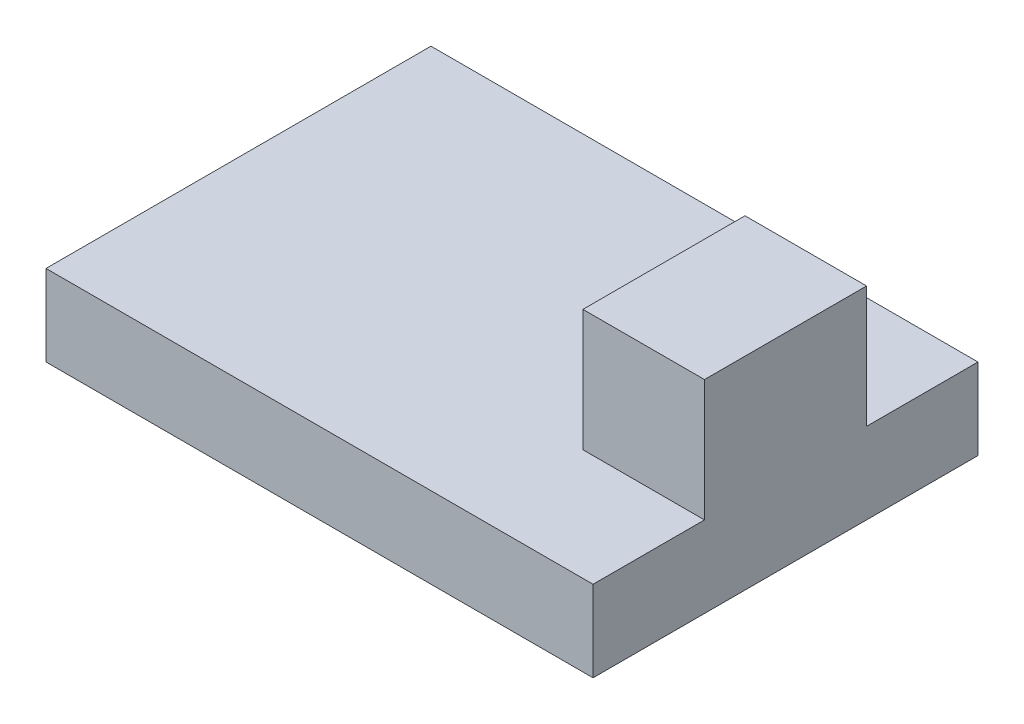
ISO-10303-21;
HEADER;
FILE_DESCRIPTION(('STEP AP214'),'2;1');
FILE_NAME('part.step','',(''),(''),'','','');
FILE_SCHEMA(('AUTOMOTIVE_DESIGN { 1 0 10303 214 1 1 1 1 }'));
ENDSEC;
DATA;
#1=APPLICATION_CONTEXT('core data for automotive mechanical design processes');
#2=APPLICATION_PROTOCOL_DEFINITION('international standard','automotive_design',2000,#1);
#3=PRODUCT_CONTEXT('',#1,'mechanical');
#4=PRODUCT('Part','Part','',(#3));
#5=PRODUCT_RELATED_PRODUCT_CATEGORY('part','',(#4));
#6=PRODUCT_DEFINITION_FORMATION('','',#4);
#7=PRODUCT_DEFINITION_CONTEXT('part definition',#1,'design');
#8=PRODUCT_DEFINITION('design','',#6,#7);
#9=PRODUCT_DEFINITION_SHAPE('','',#8);
#10=(LENGTH_UNIT() NAMED_UNIT(*) SI_UNIT(.MILLI.,.METRE.));
#11=(NAMED_UNIT(*) PLANE_ANGLE_UNIT() SI_UNIT($,.RADIAN.));
#12=(NAMED_UNIT(*) SI_UNIT($,.STERADIAN.) SOLID_ANGLE_UNIT());
#13=UNCERTAINTY_MEASURE_WITH_UNIT(LENGTH_MEASURE(1.E-05),#10,'distance_accuracy_value','');
#14=(GEOMETRIC_REPRESENTATION_CONTEXT(3) GLOBAL_UNCERTAINTY_ASSIGNED_CONTEXT((#13)) GLOBAL_UNIT_ASSIGNED_CONTEXT((#10,
#11,#12)) REPRESENTATION_CONTEXT('',''));
#15=CARTESIAN_POINT('',(0.,0.,0.));
#16=DIRECTION('',(0.,0.,1.));
#17=DIRECTION('',(1.,0.,0.));
#18=AXIS2_PLACEMENT_3D('',#15,#16,#17);
#19=CARTESIAN_POINT('',(-13.5,4.,9.5));
#20=DIRECTION('',(1.,0.,0.));
#21=DIRECTION('',(0.,0.,-1.));
#22=AXIS2_PLACEMENT_3D('',#19,#20,#21);
#23=PLANE('',#22);
#24=DIRECTION('',(0.,0.,1.));
#25=VECTOR('',#24,1.);
#26=CARTESIAN_POINT('',(-13.5,0.,9.5));
#27=LINE('',#26,#25);
#28=CARTESIAN_POINT('',(-13.5,0.,-9.5));
#29=VERTEX_POINT('',#28);
#30=CARTESIAN_POINT('',(-13.5,0.,9.5));
#31=VERTEX_POINT('',#30);
#32=EDGE_CURVE('E120',#29,#31,#27,.T.);
#33=ORIENTED_EDGE('',*,*,#32,.T.);
#34=DIRECTION('',(0.,-1.,0.));
#35=VECTOR('',#34,1.);
#36=CARTESIAN_POINT('',(-13.5,4.,9.5));
#37=LINE('',#36,#35);
#38=CARTESIAN_POINT('',(-13.5,4.,9.5));
#39=VERTEX_POINT('',#38);
#40=EDGE_CURVE('E11',#39,#31,#37,.T.);
#41=ORIENTED_EDGE('',*,*,#40,.F.);
#42=DIRECTION('',(0.,0.,1.));
#43=VECTOR('',#42,1.);
#44=CARTESIAN_POINT('',(-13.5,4.,9.5));
#45=LINE('',#44,#43);
#46=CARTESIAN_POINT('',(-13.5,4.,-9.5));
#47=VERTEX_POINT('',#46);
#48=EDGE_CURVE('E129',#47,#39,#45,.T.);
#49=ORIENTED_EDGE('',*,*,#48,.F.);
#50=DIRECTION('',(0.,-1.,0.));
#51=VECTOR('',#50,1.);
#52=CARTESIAN_POINT('',(-13.5,4.,-9.5));
#53=LINE('',#52,#51);
#54=EDGE_CURVE('E138',#47,#29,#53,.T.);
#55=ORIENTED_EDGE('',*,*,#54,.T.);
#56=EDGE_LOOP('',(#33,#41,#49,#55));
#57=FACE_BOUND('',#56,.T.);
#58=ADVANCED_FACE('F34',(#57),#23,.F.);
#59=CARTESIAN_POINT('',(13.5,4.,9.5));
#60=DIRECTION('',(0.,0.,-1.));
#61=DIRECTION('',(-1.,0.,0.));
#62=AXIS2_PLACEMENT_3D('',#59,#60,#61);
#63=PLANE('',#62);
#64=DIRECTION('',(1.,0.,0.));
#65=VECTOR('',#64,1.);
#66=CARTESIAN_POINT('',(13.5,0.,9.5));
#67=LINE('',#66,#65);
#68=CARTESIAN_POINT('',(13.5,0.,9.5));
#69=VERTEX_POINT('',#68);
#70=EDGE_CURVE('E123',#31,#69,#67,.T.);
#71=ORIENTED_EDGE('',*,*,#70,.T.);
#72=DIRECTION('',(0.,-1.,0.));
#73=VECTOR('',#72,1.);
#74=CARTESIAN_POINT('',(13.5,4.,9.5));
#75=LINE('',#74,#73);
#76=CARTESIAN_POINT('',(13.5,4.,9.5));
#77=VERTEX_POINT('',#76);
#78=EDGE_CURVE('E41',#77,#69,#75,.T.);
#79=ORIENTED_EDGE('',*,*,#78,.F.);
#80=DIRECTION('',(1.,0.,0.));
#81=VECTOR('',#80,1.);
#82=CARTESIAN_POINT('',(13.5,4.,9.5));
#83=LINE('',#82,#81);
#84=EDGE_CURVE('E132',#39,#77,#83,.T.);
#85=ORIENTED_EDGE('',*,*,#84,.F.);
#86=ORIENTED_EDGE('',*,*,#40,.T.);
#87=EDGE_LOOP('',(#71,#79,#85,#86));
#88=FACE_BOUND('',#87,.T.);
#89=ADVANCED_FACE('F165',(#88),#63,.F.);
#90=CARTESIAN_POINT('',(13.5,4.,9.5));
#91=DIRECTION('',(-1.,0.,0.));
#92=DIRECTION('',(0.,0.,1.));
#93=AXIS2_PLACEMENT_3D('',#90,#91,#92);
#94=PLANE('',#93);
#95=DIRECTION('',(0.,0.,-1.));
#96=VECTOR('',#95,1.);
#97=CARTESIAN_POINT('',(13.5,0.,9.5));
#98=LINE('',#97,#96);
#99=CARTESIAN_POINT('',(13.5,0.,-9.5));
#100=VERTEX_POINT('',#99);
#101=EDGE_CURVE('E141',#69,#100,#98,.T.);
#102=ORIENTED_EDGE('',*,*,#101,.T.);
#103=DIRECTION('',(0.,-1.,0.));
#104=VECTOR('',#103,1.);
#105=CARTESIAN_POINT('',(13.5,4.,-9.5));
#106=LINE('',#105,#104);
#107=CARTESIAN_POINT('',(13.5,4.,-9.5));
#108=VERTEX_POINT('',#107);
#109=EDGE_CURVE('E146',#108,#100,#106,.T.);
#110=ORIENTED_EDGE('',*,*,#109,.F.);
#111=DIRECTION('',(0.,0.,-1.));
#112=VECTOR('',#111,1.);
#113=CARTESIAN_POINT('',(13.5,4.,9.5));
#114=LINE('',#113,#112);
#115=CARTESIAN_POINT('',(13.5,4.,-4.));
#116=VERTEX_POINT('',#115);
#117=EDGE_CURVE('E119',#116,#108,#114,.T.);
#118=ORIENTED_EDGE('',*,*,#117,.F.);
#119=DIRECTION('',(0.,-1.,0.));
#120=VECTOR('',#119,1.);
#121=CARTESIAN_POINT('',(13.5,10.,-4.));
#122=LINE('',#121,#120);
#123=CARTESIAN_POINT('',(13.5,10.,-4.));
#124=VERTEX_POINT('',#123);
#125=EDGE_CURVE('E101',#124,#116,#122,.T.);
#126=ORIENTED_EDGE('',*,*,#125,.F.);
#127=DIRECTION('',(0.,0.,-1.));
#128=VECTOR('',#127,1.);
#129=CARTESIAN_POINT('',(13.5,10.,-4.));
#130=LINE('',#129,#128);
#131=CARTESIAN_POINT('',(13.5,10.,4.));
#132=VERTEX_POINT('',#131);
#133=EDGE_CURVE('E107',#132,#124,#130,.T.);
#134=ORIENTED_EDGE('',*,*,#133,.F.);
#135=DIRECTION('',(0.,-1.,0.));
#136=VECTOR('',#135,1.);
#137=CARTESIAN_POINT('',(13.5,10.,4.));
#138=LINE('',#137,#136);
#139=CARTESIAN_POINT('',(13.5,4.,4.));
#140=VERTEX_POINT('',#139);
#141=EDGE_CURVE('E252',#132,#140,#138,.T.);
#142=ORIENTED_EDGE('',*,*,#141,.T.);
#143=EDGE_CURVE('E135',#77,#140,#114,.T.);
#144=ORIENTED_EDGE('',*,*,#143,.F.);
#145=ORIENTED_EDGE('',*,*,#78,.T.);
#146=EDGE_LOOP('',(#102,#110,#118,#126,#134,#142,#144,#145));
#147=FACE_BOUND('',#146,.T.);
#148=ADVANCED_FACE('F117',(#147),#94,.F.);
#149=CARTESIAN_POINT('',(13.5,4.,-9.5));
#150=DIRECTION('',(0.,0.,1.));
#151=DIRECTION('',(1.,0.,0.));
#152=AXIS2_PLACEMENT_3D('',#149,#150,#151);
#153=PLANE('',#152);
#154=DIRECTION('',(-1.,0.,0.));
#155=VECTOR('',#154,1.);
#156=CARTESIAN_POINT('',(13.5,0.,-9.5));
#157=LINE('',#156,#155);
#158=EDGE_CURVE('E133',#100,#29,#157,.T.);
#159=ORIENTED_EDGE('',*,*,#158,.T.);
#160=ORIENTED_EDGE('',*,*,#54,.F.);
#161=DIRECTION('',(-1.,0.,0.));
#162=VECTOR('',#161,1.);
#163=CARTESIAN_POINT('',(13.5,4.,-9.5));
#164=LINE('',#163,#162);
#165=EDGE_CURVE('E137',#108,#47,#164,.T.);
#166=ORIENTED_EDGE('',*,*,#165,.F.);
#167=ORIENTED_EDGE('',*,*,#109,.T.);
#168=EDGE_LOOP('',(#159,#160,#166,#167));
#169=FACE_BOUND('',#168,.T.);
#170=ADVANCED_FACE('F159',(#169),#153,.F.);
#171=CARTESIAN_POINT('',(0.,4.,0.));
#172=DIRECTION('',(0.,1.,0.));
#173=DIRECTION('',(0.,0.,1.));
#174=AXIS2_PLACEMENT_3D('',#171,#172,#173);
#175=PLANE('',#174);
#176=DIRECTION('',(1.,0.,0.));
#177=VECTOR('',#176,1.);
#178=CARTESIAN_POINT('',(13.5,4.,4.));
#179=LINE('',#178,#177);
#180=CARTESIAN_POINT('',(7.5,4.,4.));
#181=VERTEX_POINT('',#180);
#182=EDGE_CURVE('E48',#181,#140,#179,.T.);
#183=ORIENTED_EDGE('',*,*,#182,.F.);
#184=DIRECTION('',(0.,0.,1.));
#185=VECTOR('',#184,1.);
#186=CARTESIAN_POINT('',(7.5,4.,-4.));
#187=LINE('',#186,#185);
#188=CARTESIAN_POINT('',(7.5,4.,-4.));
#189=VERTEX_POINT('',#188);
#190=EDGE_CURVE('E254',#189,#181,#187,.T.);
#191=ORIENTED_EDGE('',*,*,#190,.F.);
#192=DIRECTION('',(-1.,0.,0.));
#193=VECTOR('',#192,1.);
#194=CARTESIAN_POINT('',(13.5,4.,-4.));
#195=LINE('',#194,#193);
#196=EDGE_CURVE('E54',#116,#189,#195,.T.);
#197=ORIENTED_EDGE('',*,*,#196,.F.);
#198=ORIENTED_EDGE('',*,*,#117,.T.);
#199=ORIENTED_EDGE('',*,*,#165,.T.);
#200=ORIENTED_EDGE('',*,*,#48,.T.);
#201=ORIENTED_EDGE('',*,*,#84,.T.);
#202=ORIENTED_EDGE('',*,*,#143,.T.);
#203=EDGE_LOOP('',(#183,#191,#197,#198,#199,#200,#201,#202));
#204=FACE_BOUND('',#203,.T.);
#205=ADVANCED_FACE('F164',(#204),#175,.T.);
#206=CARTESIAN_POINT('',(0.,0.,0.));
#207=DIRECTION('',(0.,1.,0.));
#208=DIRECTION('',(0.,0.,1.));
#209=AXIS2_PLACEMENT_3D('',#206,#207,#208);
#210=PLANE('',#209);
#211=ORIENTED_EDGE('',*,*,#32,.F.);
#212=ORIENTED_EDGE('',*,*,#158,.F.);
#213=ORIENTED_EDGE('',*,*,#101,.F.);
#214=ORIENTED_EDGE('',*,*,#70,.F.);
#215=EDGE_LOOP('',(#211,#212,#213,#214));
#216=FACE_BOUND('',#215,.T.);
#217=ADVANCED_FACE('F156',(#216),#210,.F.);
#218=CARTESIAN_POINT('',(13.5,10.,-4.));
#219=DIRECTION('',(0.,0.,1.));
#220=DIRECTION('',(1.,0.,0.));
#221=AXIS2_PLACEMENT_3D('',#218,#219,#220);
#222=PLANE('',#221);
#223=ORIENTED_EDGE('',*,*,#196,.T.);
#224=DIRECTION('',(0.,-1.,0.));
#225=VECTOR('',#224,1.);
#226=CARTESIAN_POINT('',(7.5,10.,-4.));
#227=LINE('',#226,#225);
#228=CARTESIAN_POINT('',(7.5,10.,-4.));
#229=VERTEX_POINT('',#228);
#230=EDGE_CURVE('E103',#229,#189,#227,.T.);
#231=ORIENTED_EDGE('',*,*,#230,.F.);
#232=DIRECTION('',(-1.,0.,0.));
#233=VECTOR('',#232,1.);
#234=CARTESIAN_POINT('',(13.5,10.,-4.));
#235=LINE('',#234,#233);
#236=EDGE_CURVE('E97',#124,#229,#235,.T.);
#237=ORIENTED_EDGE('',*,*,#236,.F.);
#238=ORIENTED_EDGE('',*,*,#125,.T.);
#239=EDGE_LOOP('',(#223,#231,#237,#238));
#240=FACE_BOUND('',#239,.T.);
#241=ADVANCED_FACE('F99',(#240),#222,.F.);
#242=CARTESIAN_POINT('',(7.5,10.,-4.));
#243=DIRECTION('',(1.,0.,0.));
#244=DIRECTION('',(0.,0.,-1.));
#245=AXIS2_PLACEMENT_3D('',#242,#243,#244);
#246=PLANE('',#245);
#247=ORIENTED_EDGE('',*,*,#190,.T.);
#248=DIRECTION('',(0.,-1.,0.));
#249=VECTOR('',#248,1.);
#250=CARTESIAN_POINT('',(7.5,10.,4.));
#251=LINE('',#250,#249);
#252=CARTESIAN_POINT('',(7.5,10.,4.));
#253=VERTEX_POINT('',#252);
#254=EDGE_CURVE('E125',#253,#181,#251,.T.);
#255=ORIENTED_EDGE('',*,*,#254,.F.);
#256=DIRECTION('',(0.,0.,1.));
#257=VECTOR('',#256,1.);
#258=CARTESIAN_POINT('',(7.5,10.,-4.));
#259=LINE('',#258,#257);
#260=EDGE_CURVE('E106',#229,#253,#259,.T.);
#261=ORIENTED_EDGE('',*,*,#260,.F.);
#262=ORIENTED_EDGE('',*,*,#230,.T.);
#263=EDGE_LOOP('',(#247,#255,#261,#262));
#264=FACE_BOUND('',#263,.T.);
#265=ADVANCED_FACE('F181',(#264),#246,.F.);
#266=CARTESIAN_POINT('',(13.5,10.,4.));
#267=DIRECTION('',(0.,0.,-1.));
#268=DIRECTION('',(-1.,0.,0.));
#269=AXIS2_PLACEMENT_3D('',#266,#267,#268);
#270=PLANE('',#269);
#271=ORIENTED_EDGE('',*,*,#182,.T.);
#272=ORIENTED_EDGE('',*,*,#141,.F.);
#273=DIRECTION('',(1.,0.,0.));
#274=VECTOR('',#273,1.);
#275=CARTESIAN_POINT('',(13.5,10.,4.));
#276=LINE('',#275,#274);
#277=EDGE_CURVE('E112',#253,#132,#276,.T.);
#278=ORIENTED_EDGE('',*,*,#277,.F.);
#279=ORIENTED_EDGE('',*,*,#254,.T.);
#280=EDGE_LOOP('',(#271,#272,#278,#279));
#281=FACE_BOUND('',#280,.T.);
#282=ADVANCED_FACE('F184',(#281),#270,.F.);
#283=CARTESIAN_POINT('',(0.,10.,0.));
#284=DIRECTION('',(0.,-1.,0.));
#285=DIRECTION('',(0.,0.,-1.));
#286=AXIS2_PLACEMENT_3D('',#283,#284,#285);
#287=PLANE('',#286);
#288=ORIENTED_EDGE('',*,*,#133,.T.);
#289=ORIENTED_EDGE('',*,*,#236,.T.);
#290=ORIENTED_EDGE('',*,*,#260,.T.);
#291=ORIENTED_EDGE('',*,*,#277,.T.);
#292=EDGE_LOOP('',(#288,#289,#290,#291));
#293=FACE_BOUND('',#292,.T.);
#294=ADVANCED_FACE('F110',(#293),#287,.F.);
#295=CLOSED_SHELL('',(#58,#89,#148,#170,#205,#217,#241,#265,#282,#294));
#296=MANIFOLD_SOLID_BREP('B2',#295);
#297=ADVANCED_BREP_SHAPE_REPRESENTATION('',(#18,#296),#14);
#298=SHAPE_DEFINITION_REPRESENTATION(#9,#297);
ENDSEC;
END-ISO-10303-21;
